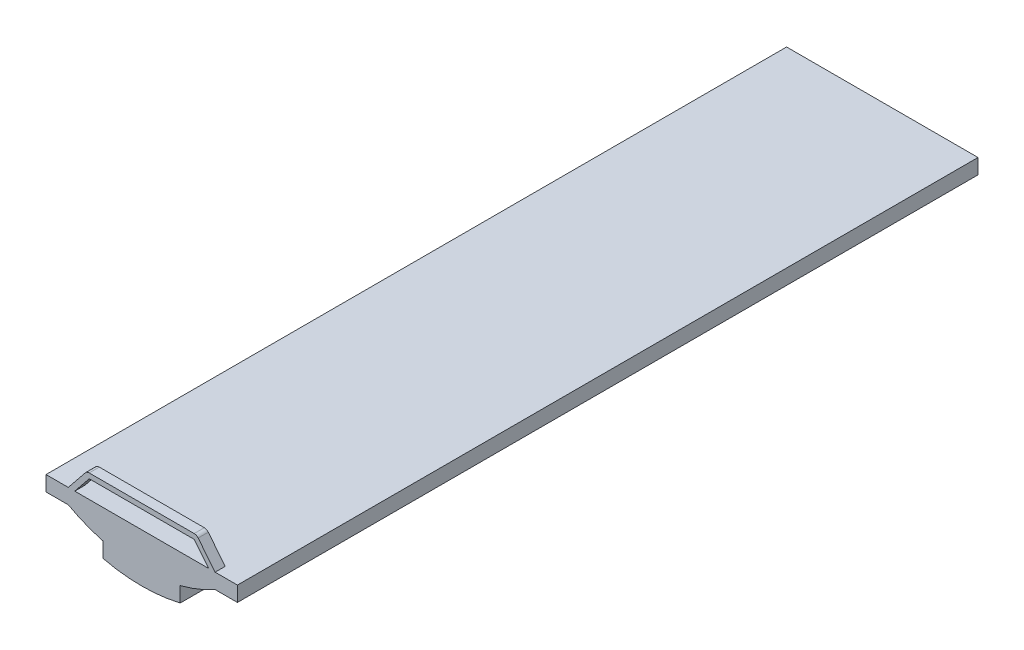
ISO-10303-21;
HEADER;
FILE_DESCRIPTION(('STEP AP214'),'2;1');
FILE_NAME('part.step','',(''),(''),'','','');
FILE_SCHEMA(('AUTOMOTIVE_DESIGN { 1 0 10303 214 1 1 1 1 }'));
ENDSEC;
DATA;
#1=APPLICATION_CONTEXT('core data for automotive mechanical design processes');
#2=APPLICATION_PROTOCOL_DEFINITION('international standard','automotive_design',2000,#1);
#3=PRODUCT_CONTEXT('',#1,'mechanical');
#4=PRODUCT('Part','Part','',(#3));
#5=PRODUCT_RELATED_PRODUCT_CATEGORY('part','',(#4));
#6=PRODUCT_DEFINITION_FORMATION('','',#4);
#7=PRODUCT_DEFINITION_CONTEXT('part definition',#1,'design');
#8=PRODUCT_DEFINITION('design','',#6,#7);
#9=PRODUCT_DEFINITION_SHAPE('','',#8);
#10=(LENGTH_UNIT() NAMED_UNIT(*) SI_UNIT(.MILLI.,.METRE.));
#11=(NAMED_UNIT(*) PLANE_ANGLE_UNIT() SI_UNIT($,.RADIAN.));
#12=(NAMED_UNIT(*) SI_UNIT($,.STERADIAN.) SOLID_ANGLE_UNIT());
#13=UNCERTAINTY_MEASURE_WITH_UNIT(LENGTH_MEASURE(1.E-05),#10,'distance_accuracy_value','');
#14=(GEOMETRIC_REPRESENTATION_CONTEXT(3) GLOBAL_UNCERTAINTY_ASSIGNED_CONTEXT((#13)) GLOBAL_UNIT_ASSIGNED_CONTEXT((#10,
#11,#12)) REPRESENTATION_CONTEXT('',''));
#15=CARTESIAN_POINT('',(0.,0.,0.));
#16=DIRECTION('',(0.,0.,1.));
#17=DIRECTION('',(1.,0.,0.));
#18=AXIS2_PLACEMENT_3D('',#15,#16,#17);
#19=CARTESIAN_POINT('',(-193.334841033241,37.4256190322048,966.629877341793));
#20=DIRECTION('',(0.,-1.,0.));
#21=DIRECTION('',(0.,0.,-1.));
#22=AXIS2_PLACEMENT_3D('',#19,#20,#21);
#23=PLANE('',#22);
#24=DIRECTION('',(1.,0.,0.));
#25=VECTOR('',#24,1.);
#26=CARTESIAN_POINT('',(198.555103217828,37.4256190322048,943.229877341793));
#27=LINE('',#26,#25);
#28=CARTESIAN_POINT('',(183.543404127248,37.4256190322048,943.229877341793));
#29=VERTEX_POINT('',#28);
#30=CARTESIAN_POINT('',(198.555103217828,37.4256190322048,943.229877341793));
#31=VERTEX_POINT('',#30);
#32=EDGE_CURVE('E213',#29,#31,#27,.T.);
#33=ORIENTED_EDGE('',*,*,#32,.T.);
#34=DIRECTION('',(0.,0.,1.));
#35=VECTOR('',#34,1.);
#36=CARTESIAN_POINT('',(198.555103217828,37.4256190322048,943.229877341793));
#37=LINE('',#36,#35);
#38=CARTESIAN_POINT('',(198.555103217828,37.4256190322048,966.629877341793));
#39=VERTEX_POINT('',#38);
#40=EDGE_CURVE('E234',#31,#39,#37,.T.);
#41=ORIENTED_EDGE('',*,*,#40,.T.);
#42=DIRECTION('',(-1.,0.,0.));
#43=VECTOR('',#42,1.);
#44=CARTESIAN_POINT('',(-193.334841033241,37.4256190322048,966.629877341793));
#45=LINE('',#44,#43);
#46=CARTESIAN_POINT('',(250.19802957243,37.4256190322048,966.629877341793));
#47=VERTEX_POINT('',#46);
#48=EDGE_CURVE('E243',#47,#39,#45,.T.);
#49=ORIENTED_EDGE('',*,*,#48,.F.);
#50=DIRECTION('',(0.,0.,-1.));
#51=VECTOR('',#50,1.);
#52=CARTESIAN_POINT('',(250.19802957243,37.4256190322048,966.629877341793));
#53=LINE('',#52,#51);
#54=CARTESIAN_POINT('',(250.19802957243,37.4256190322048,-749.370122658207));
#55=VERTEX_POINT('',#54);
#56=EDGE_CURVE('E266',#47,#55,#53,.T.);
#57=ORIENTED_EDGE('',*,*,#56,.T.);
#58=DIRECTION('',(-1.,0.,0.));
#59=VECTOR('',#58,1.);
#60=CARTESIAN_POINT('',(-193.334841033241,37.4256190322048,-749.370122658207));
#61=LINE('',#60,#59);
#62=CARTESIAN_POINT('',(-193.334841033241,37.4256190322048,-749.370122658207));
#63=VERTEX_POINT('',#62);
#64=EDGE_CURVE('E233',#55,#63,#61,.T.);
#65=ORIENTED_EDGE('',*,*,#64,.T.);
#66=DIRECTION('',(0.,0.,-1.));
#67=VECTOR('',#66,1.);
#68=CARTESIAN_POINT('',(-193.334841033241,37.4256190322048,966.629877341793));
#69=LINE('',#68,#67);
#70=CARTESIAN_POINT('',(-193.334841033241,37.4256190322048,966.629877341793));
#71=VERTEX_POINT('',#70);
#72=EDGE_CURVE('E313',#71,#63,#69,.T.);
#73=ORIENTED_EDGE('',*,*,#72,.F.);
#74=CARTESIAN_POINT('',(-141.69191467864,37.4256190322048,966.629877341793));
#75=VERTEX_POINT('',#74);
#76=EDGE_CURVE('E248',#75,#71,#45,.T.);
#77=ORIENTED_EDGE('',*,*,#76,.F.);
#78=DIRECTION('',(0.,0.,1.));
#79=VECTOR('',#78,1.);
#80=CARTESIAN_POINT('',(-141.69191467864,37.4256190322048,943.229877341793));
#81=LINE('',#80,#79);
#82=CARTESIAN_POINT('',(-141.69191467864,37.4256190322048,943.229877341793));
#83=VERTEX_POINT('',#82);
#84=EDGE_CURVE('E203',#83,#75,#81,.T.);
#85=ORIENTED_EDGE('',*,*,#84,.F.);
#86=DIRECTION('',(1.,0.,0.));
#87=VECTOR('',#86,1.);
#88=CARTESIAN_POINT('',(-141.69191467864,37.4256190322048,943.229877341793));
#89=LINE('',#88,#87);
#90=CARTESIAN_POINT('',(-126.680215588059,37.4256190322048,943.229877341793));
#91=VERTEX_POINT('',#90);
#92=EDGE_CURVE('E194',#83,#91,#89,.T.);
#93=ORIENTED_EDGE('',*,*,#92,.T.);
#94=DIRECTION('',(0.,0.,1.));
#95=VECTOR('',#94,1.);
#96=CARTESIAN_POINT('',(-126.680215588059,37.4256190322048,943.229877341793));
#97=LINE('',#96,#95);
#98=CARTESIAN_POINT('',(-126.680215588059,37.4256190322048,966.629877341793));
#99=VERTEX_POINT('',#98);
#100=EDGE_CURVE('E178',#91,#99,#97,.T.);
#101=ORIENTED_EDGE('',*,*,#100,.T.);
#102=CARTESIAN_POINT('',(183.543404127248,37.4256190322048,966.629877341793));
#103=VERTEX_POINT('',#102);
#104=EDGE_CURVE('E247',#103,#99,#45,.T.);
#105=ORIENTED_EDGE('',*,*,#104,.F.);
#106=DIRECTION('',(0.,0.,1.));
#107=VECTOR('',#106,1.);
#108=CARTESIAN_POINT('',(183.543404127248,37.4256190322048,943.229877341793));
#109=LINE('',#108,#107);
#110=EDGE_CURVE('E237',#29,#103,#109,.T.);
#111=ORIENTED_EDGE('',*,*,#110,.F.);
#112=EDGE_LOOP('',(#33,#41,#49,#57,#65,#73,#77,#85,#93,#101,#105,#111));
#113=FACE_BOUND('',#112,.T.);
#114=ADVANCED_FACE('F38',(#113),#23,.F.);
#115=CARTESIAN_POINT('',(-193.334841033241,37.4256190322048,966.629877341793));
#116=DIRECTION('',(1.,0.,0.));
#117=DIRECTION('',(0.,0.,-1.));
#118=AXIS2_PLACEMENT_3D('',#115,#116,#117);
#119=PLANE('',#118);
#120=DIRECTION('',(0.,-1.,0.));
#121=VECTOR('',#120,1.);
#122=CARTESIAN_POINT('',(-193.334841033241,37.4256190322048,-749.370122658207));
#123=LINE('',#122,#121);
#124=CARTESIAN_POINT('',(-193.334841033241,2.47670595587457,-749.370122658207));
#125=VERTEX_POINT('',#124);
#126=EDGE_CURVE('E269',#63,#125,#123,.T.);
#127=ORIENTED_EDGE('',*,*,#126,.T.);
#128=DIRECTION('',(0.,0.,-1.));
#129=VECTOR('',#128,1.);
#130=CARTESIAN_POINT('',(-193.334841033241,2.47670595587457,966.629877341793));
#131=LINE('',#130,#129);
#132=CARTESIAN_POINT('',(-193.334841033241,2.47670595587457,966.629877341793));
#133=VERTEX_POINT('',#132);
#134=EDGE_CURVE('E310',#133,#125,#131,.T.);
#135=ORIENTED_EDGE('',*,*,#134,.F.);
#136=DIRECTION('',(0.,-1.,0.));
#137=VECTOR('',#136,1.);
#138=CARTESIAN_POINT('',(-193.334841033241,37.4256190322048,966.629877341793));
#139=LINE('',#138,#137);
#140=EDGE_CURVE('E246',#71,#133,#139,.T.);
#141=ORIENTED_EDGE('',*,*,#140,.F.);
#142=ORIENTED_EDGE('',*,*,#72,.T.);
#143=EDGE_LOOP('',(#127,#135,#141,#142));
#144=FACE_BOUND('',#143,.T.);
#145=ADVANCED_FACE('F357',(#144),#119,.F.);
#146=CARTESIAN_POINT('',(-193.334841033241,2.47670595587457,966.629877341793));
#147=DIRECTION('',(0.,1.,0.));
#148=DIRECTION('',(0.,0.,1.));
#149=AXIS2_PLACEMENT_3D('',#146,#147,#148);
#150=PLANE('',#149);
#151=DIRECTION('',(1.,0.,0.));
#152=VECTOR('',#151,1.);
#153=CARTESIAN_POINT('',(-193.334841033241,2.47670595587457,-749.370122658207));
#154=LINE('',#153,#152);
#155=CARTESIAN_POINT('',(-141.69191467864,2.47670595587457,-749.370122658207));
#156=VERTEX_POINT('',#155);
#157=EDGE_CURVE('E271',#125,#156,#154,.T.);
#158=ORIENTED_EDGE('',*,*,#157,.T.);
#159=DIRECTION('',(0.,0.,-1.));
#160=VECTOR('',#159,1.);
#161=CARTESIAN_POINT('',(-141.69191467864,2.47670595587457,966.629877341793));
#162=LINE('',#161,#160);
#163=CARTESIAN_POINT('',(-141.69191467864,2.47670595587457,966.629877341793));
#164=VERTEX_POINT('',#163);
#165=EDGE_CURVE('E307',#164,#156,#162,.T.);
#166=ORIENTED_EDGE('',*,*,#165,.F.);
#167=DIRECTION('',(1.,0.,0.));
#168=VECTOR('',#167,1.);
#169=CARTESIAN_POINT('',(-193.334841033241,2.47670595587457,966.629877341793));
#170=LINE('',#169,#168);
#171=EDGE_CURVE('E250',#133,#164,#170,.T.);
#172=ORIENTED_EDGE('',*,*,#171,.F.);
#173=ORIENTED_EDGE('',*,*,#134,.T.);
#174=EDGE_LOOP('',(#158,#166,#172,#173));
#175=FACE_BOUND('',#174,.T.);
#176=ADVANCED_FACE('F362',(#175),#150,.F.);
#177=CARTESIAN_POINT('',(28.4315942695943,309.492978656753,966.629877341793));
#178=DIRECTION('',(0.,0.,-1.));
#179=DIRECTION('',(-1.,0.,0.));
#180=AXIS2_PLACEMENT_3D('',#177,#178,#179);
#181=CYLINDRICAL_SURFACE('',#180,351.);
#182=CARTESIAN_POINT('',(28.4315942695943,309.492978656753,-749.370122658207));
#183=DIRECTION('',(0.,0.,1.));
#184=DIRECTION('',(1.,0.,0.));
#185=AXIS2_PLACEMENT_3D('',#182,#183,#184);
#186=CIRCLE('',#185,351.);
#187=CARTESIAN_POINT('',(-60.8447578542242,-29.9635472069633,-749.370122658207));
#188=VERTEX_POINT('',#187);
#189=EDGE_CURVE('E273',#156,#188,#186,.T.);
#190=ORIENTED_EDGE('',*,*,#189,.T.);
#191=DIRECTION('',(0.,0.,-1.));
#192=VECTOR('',#191,1.);
#193=CARTESIAN_POINT('',(-60.8447578542242,-29.9635472069633,966.629877341793));
#194=LINE('',#193,#192);
#195=CARTESIAN_POINT('',(-60.8447578542242,-29.9635472069633,966.629877341793));
#196=VERTEX_POINT('',#195);
#197=EDGE_CURVE('E304',#196,#188,#194,.T.);
#198=ORIENTED_EDGE('',*,*,#197,.F.);
#199=CARTESIAN_POINT('',(28.4315942695943,309.492978656753,966.629877341793));
#200=DIRECTION('',(0.,0.,1.));
#201=DIRECTION('',(1.,0.,0.));
#202=AXIS2_PLACEMENT_3D('',#199,#200,#201);
#203=CIRCLE('',#202,351.);
#204=EDGE_CURVE('E252',#164,#196,#203,.T.);
#205=ORIENTED_EDGE('',*,*,#204,.F.);
#206=ORIENTED_EDGE('',*,*,#165,.T.);
#207=EDGE_LOOP('',(#190,#198,#205,#206));
#208=FACE_BOUND('',#207,.T.);
#209=ADVANCED_FACE('F403',(#208),#181,.T.);
#210=CARTESIAN_POINT('',(-60.844757854224,-29.9635472069633,966.629877341793));
#211=DIRECTION('',(1.,0.,0.));
#212=DIRECTION('',(0.,0.,-1.));
#213=AXIS2_PLACEMENT_3D('',#210,#211,#212);
#214=PLANE('',#213);
#215=DIRECTION('',(0.,-1.,0.));
#216=VECTOR('',#215,1.);
#217=CARTESIAN_POINT('',(-60.844757854224,-29.9635472069633,-749.370122658207));
#218=LINE('',#217,#216);
#219=CARTESIAN_POINT('',(-60.844757854224,-64.9124602832935,-749.370122658207));
#220=VERTEX_POINT('',#219);
#221=EDGE_CURVE('E275',#188,#220,#218,.T.);
#222=ORIENTED_EDGE('',*,*,#221,.T.);
#223=DIRECTION('',(0.,0.,-1.));
#224=VECTOR('',#223,1.);
#225=CARTESIAN_POINT('',(-60.844757854224,-64.9124602832935,966.629877341793));
#226=LINE('',#225,#224);
#227=CARTESIAN_POINT('',(-60.844757854224,-64.9124602832935,966.629877341793));
#228=VERTEX_POINT('',#227);
#229=EDGE_CURVE('E301',#228,#220,#226,.T.);
#230=ORIENTED_EDGE('',*,*,#229,.F.);
#231=DIRECTION('',(0.,-1.,0.));
#232=VECTOR('',#231,1.);
#233=CARTESIAN_POINT('',(-60.844757854224,-29.9635472069633,966.629877341793));
#234=LINE('',#233,#232);
#235=EDGE_CURVE('E254',#196,#228,#234,.T.);
#236=ORIENTED_EDGE('',*,*,#235,.F.);
#237=ORIENTED_EDGE('',*,*,#197,.T.);
#238=EDGE_LOOP('',(#222,#230,#236,#237));
#239=FACE_BOUND('',#238,.T.);
#240=ADVANCED_FACE('F408',(#239),#214,.F.);
#241=CARTESIAN_POINT('',(28.4315942695943,309.492978656753,966.629877341793));
#242=DIRECTION('',(0.,0.,-1.));
#243=DIRECTION('',(-1.,0.,0.));
#244=AXIS2_PLACEMENT_3D('',#241,#242,#243);
#245=CYLINDRICAL_SURFACE('',#244,384.90219505275);
#246=CARTESIAN_POINT('',(28.4315942695943,309.492978656753,-749.370122658207));
#247=DIRECTION('',(0.,0.,1.));
#248=DIRECTION('',(1.,0.,0.));
#249=AXIS2_PLACEMENT_3D('',#246,#247,#248);
#250=CIRCLE('',#249,384.90219505275);
#251=CARTESIAN_POINT('',(117.707946393412,-64.9124602832936,-749.370122658207));
#252=VERTEX_POINT('',#251);
#253=EDGE_CURVE('E277',#220,#252,#250,.T.);
#254=ORIENTED_EDGE('',*,*,#253,.T.);
#255=DIRECTION('',(0.,0.,-1.));
#256=VECTOR('',#255,1.);
#257=CARTESIAN_POINT('',(117.707946393412,-64.9124602832936,966.629877341793));
#258=LINE('',#257,#256);
#259=CARTESIAN_POINT('',(117.707946393412,-64.9124602832936,966.629877341793));
#260=VERTEX_POINT('',#259);
#261=EDGE_CURVE('E298',#260,#252,#258,.T.);
#262=ORIENTED_EDGE('',*,*,#261,.F.);
#263=CARTESIAN_POINT('',(28.4315942695943,309.492978656753,966.629877341793));
#264=DIRECTION('',(0.,0.,1.));
#265=DIRECTION('',(1.,0.,0.));
#266=AXIS2_PLACEMENT_3D('',#263,#264,#265);
#267=CIRCLE('',#266,384.90219505275);
#268=EDGE_CURVE('E256',#228,#260,#267,.T.);
#269=ORIENTED_EDGE('',*,*,#268,.F.);
#270=ORIENTED_EDGE('',*,*,#229,.T.);
#271=EDGE_LOOP('',(#254,#262,#269,#270));
#272=FACE_BOUND('',#271,.T.);
#273=ADVANCED_FACE('F414',(#272),#245,.T.);
#274=CARTESIAN_POINT('',(117.707946393413,-29.9635472069633,966.629877341793));
#275=DIRECTION('',(-1.,0.,0.));
#276=DIRECTION('',(0.,0.,1.));
#277=AXIS2_PLACEMENT_3D('',#274,#275,#276);
#278=PLANE('',#277);
#279=DIRECTION('',(0.,1.,0.));
#280=VECTOR('',#279,1.);
#281=CARTESIAN_POINT('',(117.707946393413,-29.9635472069633,-749.370122658207));
#282=LINE('',#281,#280);
#283=CARTESIAN_POINT('',(117.707946393413,-29.9635472069633,-749.370122658207));
#284=VERTEX_POINT('',#283);
#285=EDGE_CURVE('E279',#252,#284,#282,.T.);
#286=ORIENTED_EDGE('',*,*,#285,.T.);
#287=DIRECTION('',(0.,0.,-1.));
#288=VECTOR('',#287,1.);
#289=CARTESIAN_POINT('',(117.707946393413,-29.9635472069633,966.629877341793));
#290=LINE('',#289,#288);
#291=CARTESIAN_POINT('',(117.707946393413,-29.9635472069633,966.629877341793));
#292=VERTEX_POINT('',#291);
#293=EDGE_CURVE('E295',#292,#284,#290,.T.);
#294=ORIENTED_EDGE('',*,*,#293,.F.);
#295=DIRECTION('',(0.,1.,0.));
#296=VECTOR('',#295,1.);
#297=CARTESIAN_POINT('',(117.707946393413,-29.9635472069633,966.629877341793));
#298=LINE('',#297,#296);
#299=EDGE_CURVE('E258',#260,#292,#298,.T.);
#300=ORIENTED_EDGE('',*,*,#299,.F.);
#301=ORIENTED_EDGE('',*,*,#261,.T.);
#302=EDGE_LOOP('',(#286,#294,#300,#301));
#303=FACE_BOUND('',#302,.T.);
#304=ADVANCED_FACE('F418',(#303),#278,.F.);
#305=CARTESIAN_POINT('',(28.4315942695943,309.492978656753,966.629877341793));
#306=DIRECTION('',(0.,0.,-1.));
#307=DIRECTION('',(-1.,0.,0.));
#308=AXIS2_PLACEMENT_3D('',#305,#306,#307);
#309=CYLINDRICAL_SURFACE('',#308,351.);
#310=CARTESIAN_POINT('',(28.4315942695943,309.492978656753,-749.370122658207));
#311=DIRECTION('',(0.,0.,1.));
#312=DIRECTION('',(1.,0.,0.));
#313=AXIS2_PLACEMENT_3D('',#310,#311,#312);
#314=CIRCLE('',#313,351.);
#315=CARTESIAN_POINT('',(198.555103217828,2.47670595587452,-749.370122658207));
#316=VERTEX_POINT('',#315);
#317=EDGE_CURVE('E281',#284,#316,#314,.T.);
#318=ORIENTED_EDGE('',*,*,#317,.T.);
#319=DIRECTION('',(0.,0.,-1.));
#320=VECTOR('',#319,1.);
#321=CARTESIAN_POINT('',(198.555103217828,2.47670595587452,966.629877341793));
#322=LINE('',#321,#320);
#323=CARTESIAN_POINT('',(198.555103217828,2.47670595587452,966.629877341793));
#324=VERTEX_POINT('',#323);
#325=EDGE_CURVE('E292',#324,#316,#322,.T.);
#326=ORIENTED_EDGE('',*,*,#325,.F.);
#327=CARTESIAN_POINT('',(28.4315942695943,309.492978656753,966.629877341793));
#328=DIRECTION('',(0.,0.,1.));
#329=DIRECTION('',(1.,0.,0.));
#330=AXIS2_PLACEMENT_3D('',#327,#328,#329);
#331=CIRCLE('',#330,351.);
#332=EDGE_CURVE('E260',#292,#324,#331,.T.);
#333=ORIENTED_EDGE('',*,*,#332,.F.);
#334=ORIENTED_EDGE('',*,*,#293,.T.);
#335=EDGE_LOOP('',(#318,#326,#333,#334));
#336=FACE_BOUND('',#335,.T.);
#337=ADVANCED_FACE('F423',(#336),#309,.T.);
#338=CARTESIAN_POINT('',(250.19802957243,2.47670595587463,966.629877341793));
#339=DIRECTION('',(0.,1.,0.));
#340=DIRECTION('',(-1.,0.,0.));
#341=AXIS2_PLACEMENT_3D('',#338,#339,#340);
#342=PLANE('',#341);
#343=DIRECTION('',(1.,0.,0.));
#344=VECTOR('',#343,1.);
#345=CARTESIAN_POINT('',(250.19802957243,2.47670595587463,-749.370122658207));
#346=LINE('',#345,#344);
#347=CARTESIAN_POINT('',(250.19802957243,2.47670595587463,-749.370122658207));
#348=VERTEX_POINT('',#347);
#349=EDGE_CURVE('E283',#316,#348,#346,.T.);
#350=ORIENTED_EDGE('',*,*,#349,.T.);
#351=DIRECTION('',(0.,0.,-1.));
#352=VECTOR('',#351,1.);
#353=CARTESIAN_POINT('',(250.19802957243,2.47670595587463,966.629877341793));
#354=LINE('',#353,#352);
#355=CARTESIAN_POINT('',(250.19802957243,2.47670595587463,966.629877341793));
#356=VERTEX_POINT('',#355);
#357=EDGE_CURVE('E289',#356,#348,#354,.T.);
#358=ORIENTED_EDGE('',*,*,#357,.F.);
#359=DIRECTION('',(1.,0.,0.));
#360=VECTOR('',#359,1.);
#361=CARTESIAN_POINT('',(250.19802957243,2.47670595587463,966.629877341793));
#362=LINE('',#361,#360);
#363=EDGE_CURVE('E262',#324,#356,#362,.T.);
#364=ORIENTED_EDGE('',*,*,#363,.F.);
#365=ORIENTED_EDGE('',*,*,#325,.T.);
#366=EDGE_LOOP('',(#350,#358,#364,#365));
#367=FACE_BOUND('',#366,.T.);
#368=ADVANCED_FACE('F427',(#367),#342,.F.);
#369=CARTESIAN_POINT('',(250.19802957243,37.4256190322048,966.629877341793));
#370=DIRECTION('',(-1.,0.,0.));
#371=DIRECTION('',(0.,0.,1.));
#372=AXIS2_PLACEMENT_3D('',#369,#370,#371);
#373=PLANE('',#372);
#374=DIRECTION('',(0.,1.,0.));
#375=VECTOR('',#374,1.);
#376=CARTESIAN_POINT('',(250.19802957243,37.4256190322048,-749.370122658207));
#377=LINE('',#376,#375);
#378=EDGE_CURVE('E285',#348,#55,#377,.T.);
#379=ORIENTED_EDGE('',*,*,#378,.T.);
#380=ORIENTED_EDGE('',*,*,#56,.F.);
#381=DIRECTION('',(0.,1.,0.));
#382=VECTOR('',#381,1.);
#383=CARTESIAN_POINT('',(250.19802957243,37.4256190322048,966.629877341793));
#384=LINE('',#383,#382);
#385=EDGE_CURVE('E264',#356,#47,#384,.T.);
#386=ORIENTED_EDGE('',*,*,#385,.F.);
#387=ORIENTED_EDGE('',*,*,#357,.T.);
#388=EDGE_LOOP('',(#379,#380,#386,#387));
#389=FACE_BOUND('',#388,.T.);
#390=ADVANCED_FACE('F428',(#389),#373,.F.);
#391=CARTESIAN_POINT('',(28.4315942695943,309.492978656753,966.629877341793));
#392=DIRECTION('',(0.,0.,1.));
#393=DIRECTION('',(1.,0.,0.));
#394=AXIS2_PLACEMENT_3D('',#391,#392,#393);
#395=PLANE('',#394);
#396=ORIENTED_EDGE('',*,*,#104,.T.);
#397=DIRECTION('',(0.62653644834305,0.779392121398258,0.));
#398=VECTOR('',#397,1.);
#399=CARTESIAN_POINT('',(-126.680215588059,37.4256190322048,966.629877341793));
#400=LINE('',#399,#398);
#401=CARTESIAN_POINT('',(-93.2441937011028,79.0190045383656,966.629877341793));
#402=VERTEX_POINT('',#401);
#403=EDGE_CURVE('E183',#99,#402,#400,.T.);
#404=ORIENTED_EDGE('',*,*,#403,.T.);
#405=DIRECTION('',(1.,0.,0.));
#406=VECTOR('',#405,1.);
#407=CARTESIAN_POINT('',(-93.2441937011028,79.0190045383656,966.629877341793));
#408=LINE('',#407,#406);
#409=CARTESIAN_POINT('',(150.107382240291,79.0190045383656,966.629877341793));
#410=VERTEX_POINT('',#409);
#411=EDGE_CURVE('E222',#402,#410,#408,.T.);
#412=ORIENTED_EDGE('',*,*,#411,.T.);
#413=DIRECTION('',(0.62653644834305,-0.779392121398258,0.));
#414=VECTOR('',#413,1.);
#415=CARTESIAN_POINT('',(183.543404127248,37.4256190322048,966.629877341793));
#416=LINE('',#415,#414);
#417=EDGE_CURVE('E225',#410,#103,#416,.T.);
#418=ORIENTED_EDGE('',*,*,#417,.T.);
#419=EDGE_LOOP('',(#396,#404,#412,#418));
#420=FACE_BOUND('',#419,.T.);
#421=DIRECTION('',(-1.,0.,0.));
#422=VECTOR('',#421,1.);
#423=CARTESIAN_POINT('',(-98.8505161598765,90.7190045383657,966.629877341793));
#424=LINE('',#423,#422);
#425=CARTESIAN_POINT('',(150.107382240291,90.7190045383657,966.629877341793));
#426=VERTEX_POINT('',#425);
#427=CARTESIAN_POINT('',(-93.2441937011028,90.7190045383657,966.629877341793));
#428=VERTEX_POINT('',#427);
#429=EDGE_CURVE('E206',#426,#428,#424,.T.);
#430=ORIENTED_EDGE('',*,*,#429,.T.);
#431=CARTESIAN_POINT('',(-93.2441937011028,79.0190045383656,966.629877341793));
#432=DIRECTION('',(0.,0.,1.));
#433=DIRECTION('',(1.,0.,0.));
#434=AXIS2_PLACEMENT_3D('',#431,#432,#433);
#435=CIRCLE('',#434,11.7);
#436=CARTESIAN_POINT('',(-102.363081521462,86.3494809839793,966.629877341793));
#437=VERTEX_POINT('',#436);
#438=EDGE_CURVE('E323',#428,#437,#435,.T.);
#439=ORIENTED_EDGE('',*,*,#438,.T.);
#440=DIRECTION('',(-0.62653644834305,-0.779392121398258,0.));
#441=VECTOR('',#440,1.);
#442=CARTESIAN_POINT('',(-141.69191467864,37.4256190322048,966.629877341793));
#443=LINE('',#442,#441);
#444=EDGE_CURVE('E204',#437,#75,#443,.T.);
#445=ORIENTED_EDGE('',*,*,#444,.T.);
#446=ORIENTED_EDGE('',*,*,#76,.T.);
#447=ORIENTED_EDGE('',*,*,#140,.T.);
#448=ORIENTED_EDGE('',*,*,#171,.T.);
#449=ORIENTED_EDGE('',*,*,#204,.T.);
#450=ORIENTED_EDGE('',*,*,#235,.T.);
#451=ORIENTED_EDGE('',*,*,#268,.T.);
#452=ORIENTED_EDGE('',*,*,#299,.T.);
#453=ORIENTED_EDGE('',*,*,#332,.T.);
#454=ORIENTED_EDGE('',*,*,#363,.T.);
#455=ORIENTED_EDGE('',*,*,#385,.T.);
#456=ORIENTED_EDGE('',*,*,#48,.T.);
#457=DIRECTION('',(-0.62653644834305,0.779392121398258,0.));
#458=VECTOR('',#457,1.);
#459=CARTESIAN_POINT('',(198.555103217828,37.4256190322048,966.629877341793));
#460=LINE('',#459,#458);
#461=CARTESIAN_POINT('',(159.226270060651,86.3494809839793,966.629877341793));
#462=VERTEX_POINT('',#461);
#463=EDGE_CURVE('E227',#39,#462,#460,.T.);
#464=ORIENTED_EDGE('',*,*,#463,.T.);
#465=CARTESIAN_POINT('',(150.107382240291,79.0190045383656,966.629877341793));
#466=DIRECTION('',(0.,0.,1.));
#467=DIRECTION('',(1.,0.,0.));
#468=AXIS2_PLACEMENT_3D('',#465,#466,#467);
#469=CIRCLE('',#468,11.7);
#470=EDGE_CURVE('E321',#462,#426,#469,.T.);
#471=ORIENTED_EDGE('',*,*,#470,.T.);
#472=EDGE_LOOP('',(#430,#439,#445,#446,#447,#448,#449,#450,#451,#452,#453,#454,#455,#456,#464,#471));
#473=FACE_BOUND('',#472,.T.);
#474=ADVANCED_FACE('F335',(#420,#473),#395,.T.);
#475=CARTESIAN_POINT('',(28.4315942695943,309.492978656753,-749.370122658207));
#476=DIRECTION('',(0.,0.,1.));
#477=DIRECTION('',(1.,0.,0.));
#478=AXIS2_PLACEMENT_3D('',#475,#476,#477);
#479=PLANE('',#478);
#480=ORIENTED_EDGE('',*,*,#64,.F.);
#481=ORIENTED_EDGE('',*,*,#378,.F.);
#482=ORIENTED_EDGE('',*,*,#349,.F.);
#483=ORIENTED_EDGE('',*,*,#317,.F.);
#484=ORIENTED_EDGE('',*,*,#285,.F.);
#485=ORIENTED_EDGE('',*,*,#253,.F.);
#486=ORIENTED_EDGE('',*,*,#221,.F.);
#487=ORIENTED_EDGE('',*,*,#189,.F.);
#488=ORIENTED_EDGE('',*,*,#157,.F.);
#489=ORIENTED_EDGE('',*,*,#126,.F.);
#490=EDGE_LOOP('',(#480,#481,#482,#483,#484,#485,#486,#487,#488,#489));
#491=FACE_BOUND('',#490,.T.);
#492=ADVANCED_FACE('F378',(#491),#479,.F.);
#493=CARTESIAN_POINT('',(-141.69191467864,37.4256190322048,943.229877341793));
#494=DIRECTION('',(-0.779392121398258,0.62653644834305,0.));
#495=DIRECTION('',(-0.62653644834305,-0.779392121398258,0.));
#496=AXIS2_PLACEMENT_3D('',#493,#494,#495);
#497=PLANE('',#496);
#498=ORIENTED_EDGE('',*,*,#444,.F.);
#499=DIRECTION('',(0.,0.,1.));
#500=VECTOR('',#499,1.);
#501=CARTESIAN_POINT('',(-102.363081521462,86.3494809839793,943.229877341793));
#502=LINE('',#501,#500);
#503=CARTESIAN_POINT('',(-102.363081521462,86.3494809839793,943.229877341793));
#504=VERTEX_POINT('',#503);
#505=EDGE_CURVE('E61',#437,#504,#502,.F.);
#506=ORIENTED_EDGE('',*,*,#505,.T.);
#507=DIRECTION('',(-0.62653644834305,-0.779392121398258,0.));
#508=VECTOR('',#507,1.);
#509=CARTESIAN_POINT('',(-141.69191467864,37.4256190322048,943.229877341793));
#510=LINE('',#509,#508);
#511=EDGE_CURVE('E189',#504,#83,#510,.T.);
#512=ORIENTED_EDGE('',*,*,#511,.T.);
#513=ORIENTED_EDGE('',*,*,#84,.T.);
#514=EDGE_LOOP('',(#498,#506,#512,#513));
#515=FACE_BOUND('',#514,.T.);
#516=ADVANCED_FACE('F336',(#515),#497,.T.);
#517=CARTESIAN_POINT('',(-98.8505161598765,90.7190045383657,943.229877341793));
#518=DIRECTION('',(0.,1.,0.));
#519=DIRECTION('',(0.,0.,1.));
#520=AXIS2_PLACEMENT_3D('',#517,#518,#519);
#521=PLANE('',#520);
#522=DIRECTION('',(-1.,0.,0.));
#523=VECTOR('',#522,1.);
#524=CARTESIAN_POINT('',(-98.8505161598765,90.7190045383657,943.229877341793));
#525=LINE('',#524,#523);
#526=CARTESIAN_POINT('',(150.107382240291,90.7190045383657,943.229877341793));
#527=VERTEX_POINT('',#526);
#528=CARTESIAN_POINT('',(-93.2441937011028,90.7190045383657,943.229877341793));
#529=VERTEX_POINT('',#528);
#530=EDGE_CURVE('E217',#527,#529,#525,.T.);
#531=ORIENTED_EDGE('',*,*,#530,.T.);
#532=DIRECTION('',(0.,0.,1.));
#533=VECTOR('',#532,1.);
#534=CARTESIAN_POINT('',(-93.2441937011028,90.7190045383657,943.229877341793));
#535=LINE('',#534,#533);
#536=EDGE_CURVE('E318',#529,#428,#535,.T.);
#537=ORIENTED_EDGE('',*,*,#536,.T.);
#538=ORIENTED_EDGE('',*,*,#429,.F.);
#539=DIRECTION('',(0.,0.,1.));
#540=VECTOR('',#539,1.);
#541=CARTESIAN_POINT('',(150.107382240291,90.7190045383657,943.229877341793));
#542=LINE('',#541,#540);
#543=EDGE_CURVE('E316',#426,#527,#542,.F.);
#544=ORIENTED_EDGE('',*,*,#543,.T.);
#545=EDGE_LOOP('',(#531,#537,#538,#544));
#546=FACE_BOUND('',#545,.T.);
#547=ADVANCED_FACE('F330',(#546),#521,.T.);
#548=CARTESIAN_POINT('',(198.555103217828,37.4256190322048,943.229877341793));
#549=DIRECTION('',(0.779392121398258,0.62653644834305,0.));
#550=DIRECTION('',(-0.62653644834305,0.779392121398258,0.));
#551=AXIS2_PLACEMENT_3D('',#548,#549,#550);
#552=PLANE('',#551);
#553=DIRECTION('',(-0.62653644834305,0.779392121398258,0.));
#554=VECTOR('',#553,1.);
#555=CARTESIAN_POINT('',(198.555103217828,37.4256190322048,943.229877341793));
#556=LINE('',#555,#554);
#557=CARTESIAN_POINT('',(159.226270060651,86.3494809839793,943.229877341793));
#558=VERTEX_POINT('',#557);
#559=EDGE_CURVE('E215',#31,#558,#556,.T.);
#560=ORIENTED_EDGE('',*,*,#559,.T.);
#561=DIRECTION('',(0.,0.,1.));
#562=VECTOR('',#561,1.);
#563=CARTESIAN_POINT('',(159.226270060651,86.3494809839793,943.229877341793));
#564=LINE('',#563,#562);
#565=EDGE_CURVE('E11',#558,#462,#564,.T.);
#566=ORIENTED_EDGE('',*,*,#565,.T.);
#567=ORIENTED_EDGE('',*,*,#463,.F.);
#568=ORIENTED_EDGE('',*,*,#40,.F.);
#569=EDGE_LOOP('',(#560,#566,#567,#568));
#570=FACE_BOUND('',#569,.T.);
#571=ADVANCED_FACE('F354',(#570),#552,.T.);
#572=CARTESIAN_POINT('',(183.543404127248,37.4256190322048,943.229877341793));
#573=DIRECTION('',(-0.779392121398258,-0.62653644834305,0.));
#574=DIRECTION('',(0.62653644834305,-0.779392121398258,0.));
#575=AXIS2_PLACEMENT_3D('',#572,#573,#574);
#576=PLANE('',#575);
#577=ORIENTED_EDGE('',*,*,#417,.F.);
#578=DIRECTION('',(0.,0.,1.));
#579=VECTOR('',#578,1.);
#580=CARTESIAN_POINT('',(150.107382240291,79.0190045383656,943.229877341793));
#581=LINE('',#580,#579);
#582=CARTESIAN_POINT('',(150.107382240291,79.0190045383656,943.229877341793));
#583=VERTEX_POINT('',#582);
#584=EDGE_CURVE('E240',#583,#410,#581,.T.);
#585=ORIENTED_EDGE('',*,*,#584,.F.);
#586=DIRECTION('',(0.62653644834305,-0.779392121398258,0.));
#587=VECTOR('',#586,1.);
#588=CARTESIAN_POINT('',(183.543404127248,37.4256190322048,943.229877341793));
#589=LINE('',#588,#587);
#590=EDGE_CURVE('E210',#583,#29,#589,.T.);
#591=ORIENTED_EDGE('',*,*,#590,.T.);
#592=ORIENTED_EDGE('',*,*,#110,.T.);
#593=EDGE_LOOP('',(#577,#585,#591,#592));
#594=FACE_BOUND('',#593,.T.);
#595=ADVANCED_FACE('F343',(#594),#576,.T.);
#596=CARTESIAN_POINT('',(-93.2441937011028,79.0190045383656,943.229877341793));
#597=DIRECTION('',(0.,-1.,0.));
#598=DIRECTION('',(0.,0.,-1.));
#599=AXIS2_PLACEMENT_3D('',#596,#597,#598);
#600=PLANE('',#599);
#601=ORIENTED_EDGE('',*,*,#411,.F.);
#602=DIRECTION('',(0.,0.,1.));
#603=VECTOR('',#602,1.);
#604=CARTESIAN_POINT('',(-93.2441937011028,79.0190045383656,943.229877341793));
#605=LINE('',#604,#603);
#606=CARTESIAN_POINT('',(-93.2441937011028,79.0190045383656,943.229877341793));
#607=VERTEX_POINT('',#606);
#608=EDGE_CURVE('E188',#607,#402,#605,.T.);
#609=ORIENTED_EDGE('',*,*,#608,.F.);
#610=DIRECTION('',(1.,0.,0.));
#611=VECTOR('',#610,1.);
#612=CARTESIAN_POINT('',(-93.2441937011028,79.0190045383656,943.229877341793));
#613=LINE('',#612,#611);
#614=EDGE_CURVE('E198',#607,#583,#613,.T.);
#615=ORIENTED_EDGE('',*,*,#614,.T.);
#616=ORIENTED_EDGE('',*,*,#584,.T.);
#617=EDGE_LOOP('',(#601,#609,#615,#616));
#618=FACE_BOUND('',#617,.T.);
#619=ADVANCED_FACE('F346',(#618),#600,.T.);
#620=CARTESIAN_POINT('',(-126.680215588059,37.4256190322048,943.229877341793));
#621=DIRECTION('',(0.779392121398258,-0.62653644834305,0.));
#622=DIRECTION('',(0.62653644834305,0.779392121398258,0.));
#623=AXIS2_PLACEMENT_3D('',#620,#621,#622);
#624=PLANE('',#623);
#625=ORIENTED_EDGE('',*,*,#403,.F.);
#626=ORIENTED_EDGE('',*,*,#100,.F.);
#627=DIRECTION('',(0.62653644834305,0.779392121398258,0.));
#628=VECTOR('',#627,1.);
#629=CARTESIAN_POINT('',(-126.680215588059,37.4256190322048,943.229877341793));
#630=LINE('',#629,#628);
#631=EDGE_CURVE('E181',#91,#607,#630,.T.);
#632=ORIENTED_EDGE('',*,*,#631,.T.);
#633=ORIENTED_EDGE('',*,*,#608,.T.);
#634=EDGE_LOOP('',(#625,#626,#632,#633));
#635=FACE_BOUND('',#634,.T.);
#636=ADVANCED_FACE('F180',(#635),#624,.T.);
#637=CARTESIAN_POINT('',(-193.334841033241,37.4256190322048,943.229877341793));
#638=DIRECTION('',(0.,0.,1.));
#639=DIRECTION('',(1.,0.,0.));
#640=AXIS2_PLACEMENT_3D('',#637,#638,#639);
#641=PLANE('',#640);
#642=ORIENTED_EDGE('',*,*,#511,.F.);
#643=CARTESIAN_POINT('',(-93.2441937011028,79.0190045383656,943.229877341793));
#644=DIRECTION('',(0.,0.,1.));
#645=DIRECTION('',(1.,0.,0.));
#646=AXIS2_PLACEMENT_3D('',#643,#644,#645);
#647=CIRCLE('',#646,11.7);
#648=EDGE_CURVE('E46',#504,#529,#647,.F.);
#649=ORIENTED_EDGE('',*,*,#648,.T.);
#650=ORIENTED_EDGE('',*,*,#530,.F.);
#651=CARTESIAN_POINT('',(150.107382240291,79.0190045383656,943.229877341793));
#652=DIRECTION('',(0.,0.,1.));
#653=DIRECTION('',(1.,0.,0.));
#654=AXIS2_PLACEMENT_3D('',#651,#652,#653);
#655=CIRCLE('',#654,11.7);
#656=EDGE_CURVE('E53',#527,#558,#655,.F.);
#657=ORIENTED_EDGE('',*,*,#656,.T.);
#658=ORIENTED_EDGE('',*,*,#559,.F.);
#659=ORIENTED_EDGE('',*,*,#32,.F.);
#660=ORIENTED_EDGE('',*,*,#590,.F.);
#661=ORIENTED_EDGE('',*,*,#614,.F.);
#662=ORIENTED_EDGE('',*,*,#631,.F.);
#663=ORIENTED_EDGE('',*,*,#92,.F.);
#664=EDGE_LOOP('',(#642,#649,#650,#657,#658,#659,#660,#661,#662,#663));
#665=FACE_BOUND('',#664,.T.);
#666=ADVANCED_FACE('F193',(#665),#641,.F.);
#667=CARTESIAN_POINT('',(-93.2441937011028,79.0190045383656,943.229877341793));
#668=DIRECTION('',(0.,0.,1.));
#669=DIRECTION('',(1.,0.,0.));
#670=AXIS2_PLACEMENT_3D('',#667,#668,#669);
#671=CYLINDRICAL_SURFACE('',#670,11.7);
#672=ORIENTED_EDGE('',*,*,#648,.F.);
#673=ORIENTED_EDGE('',*,*,#505,.F.);
#674=ORIENTED_EDGE('',*,*,#438,.F.);
#675=ORIENTED_EDGE('',*,*,#536,.F.);
#676=EDGE_LOOP('',(#672,#673,#674,#675));
#677=FACE_BOUND('',#676,.T.);
#678=ADVANCED_FACE('F333',(#677),#671,.T.);
#679=CARTESIAN_POINT('',(150.107382240291,79.0190045383656,943.229877341793));
#680=DIRECTION('',(0.,0.,1.));
#681=DIRECTION('',(1.,0.,0.));
#682=AXIS2_PLACEMENT_3D('',#679,#680,#681);
#683=CYLINDRICAL_SURFACE('',#682,11.7);
#684=ORIENTED_EDGE('',*,*,#656,.F.);
#685=ORIENTED_EDGE('',*,*,#543,.F.);
#686=ORIENTED_EDGE('',*,*,#470,.F.);
#687=ORIENTED_EDGE('',*,*,#565,.F.);
#688=EDGE_LOOP('',(#684,#685,#686,#687));
#689=FACE_BOUND('',#688,.T.);
#690=ADVANCED_FACE('F40',(#689),#683,.T.);
#691=CLOSED_SHELL('',(#114,#145,#176,#209,#240,#273,#304,#337,#368,#390,#474,#492,#516,#547,
#571,#595,#619,#636,#666,#678,#690));
#692=MANIFOLD_SOLID_BREP('B2',#691);
#693=ADVANCED_BREP_SHAPE_REPRESENTATION('',(#18,#692),#14);
#694=SHAPE_DEFINITION_REPRESENTATION(#9,#693);
ENDSEC;
END-ISO-10303-21;
